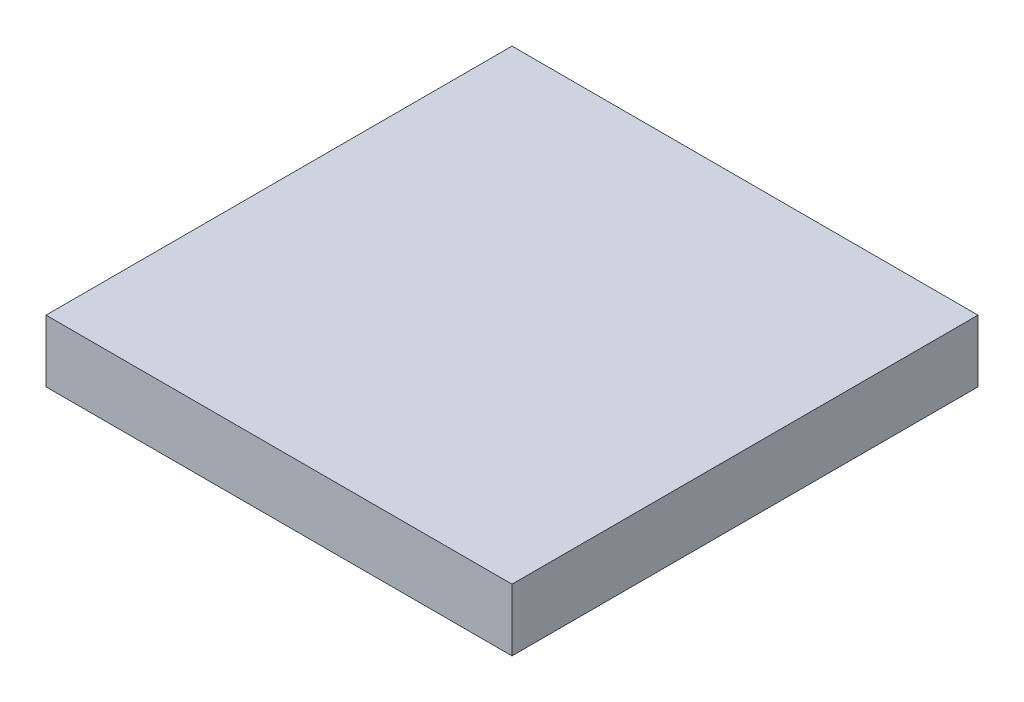
ISO-10303-21;
HEADER;
FILE_DESCRIPTION(('STEP AP214'),'2;1');
FILE_NAME('part.step','',(''),(''),'','','');
FILE_SCHEMA(('AUTOMOTIVE_DESIGN { 1 0 10303 214 1 1 1 1 }'));
ENDSEC;
DATA;
#1=APPLICATION_CONTEXT('core data for automotive mechanical design processes');
#2=APPLICATION_PROTOCOL_DEFINITION('international standard','automotive_design',2000,#1);
#3=PRODUCT_CONTEXT('',#1,'mechanical');
#4=PRODUCT('Part','Part','',(#3));
#5=PRODUCT_RELATED_PRODUCT_CATEGORY('part','',(#4));
#6=PRODUCT_DEFINITION_FORMATION('','',#4);
#7=PRODUCT_DEFINITION_CONTEXT('part definition',#1,'design');
#8=PRODUCT_DEFINITION('design','',#6,#7);
#9=PRODUCT_DEFINITION_SHAPE('','',#8);
#10=(LENGTH_UNIT() NAMED_UNIT(*) SI_UNIT(.MILLI.,.METRE.));
#11=(NAMED_UNIT(*) PLANE_ANGLE_UNIT() SI_UNIT($,.RADIAN.));
#12=(NAMED_UNIT(*) SI_UNIT($,.STERADIAN.) SOLID_ANGLE_UNIT());
#13=UNCERTAINTY_MEASURE_WITH_UNIT(LENGTH_MEASURE(1.E-05),#10,'distance_accuracy_value','');
#14=(GEOMETRIC_REPRESENTATION_CONTEXT(3) GLOBAL_UNCERTAINTY_ASSIGNED_CONTEXT((#13)) GLOBAL_UNIT_ASSIGNED_CONTEXT((#10,
#11,#12)) REPRESENTATION_CONTEXT('',''));
#15=CARTESIAN_POINT('',(0.,0.,0.));
#16=DIRECTION('',(0.,0.,1.));
#17=DIRECTION('',(1.,0.,0.));
#18=AXIS2_PLACEMENT_3D('',#15,#16,#17);
#19=CARTESIAN_POINT('',(0.,1.6,-12.));
#20=DIRECTION('',(1.,0.,0.));
#21=DIRECTION('',(0.,0.,-1.));
#22=AXIS2_PLACEMENT_3D('',#19,#20,#21);
#23=PLANE('',#22);
#24=DIRECTION('',(0.,0.,1.));
#25=VECTOR('',#24,1.);
#26=CARTESIAN_POINT('',(0.,0.,-12.));
#27=LINE('',#26,#25);
#28=CARTESIAN_POINT('',(0.,0.,-12.));
#29=VERTEX_POINT('',#28);
#30=CARTESIAN_POINT('',(0.,0.,0.));
#31=VERTEX_POINT('',#30);
#32=EDGE_CURVE('E110',#29,#31,#27,.T.);
#33=ORIENTED_EDGE('',*,*,#32,.T.);
#34=DIRECTION('',(0.,-1.,0.));
#35=VECTOR('',#34,1.);
#36=CARTESIAN_POINT('',(0.,1.6,0.));
#37=LINE('',#36,#35);
#38=CARTESIAN_POINT('',(0.,1.6,0.));
#39=VERTEX_POINT('',#38);
#40=EDGE_CURVE('E11',#39,#31,#37,.T.);
#41=ORIENTED_EDGE('',*,*,#40,.F.);
#42=DIRECTION('',(0.,0.,1.));
#43=VECTOR('',#42,1.);
#44=CARTESIAN_POINT('',(0.,1.6,-12.));
#45=LINE('',#44,#43);
#46=CARTESIAN_POINT('',(0.,1.6,-12.));
#47=VERTEX_POINT('',#46);
#48=EDGE_CURVE('E94',#47,#39,#45,.T.);
#49=ORIENTED_EDGE('',*,*,#48,.F.);
#50=DIRECTION('',(0.,-1.,0.));
#51=VECTOR('',#50,1.);
#52=CARTESIAN_POINT('',(0.,1.6,-12.));
#53=LINE('',#52,#51);
#54=EDGE_CURVE('E106',#47,#29,#53,.T.);
#55=ORIENTED_EDGE('',*,*,#54,.T.);
#56=EDGE_LOOP('',(#33,#41,#49,#55));
#57=FACE_BOUND('',#56,.T.);
#58=ADVANCED_FACE('F42',(#57),#23,.F.);
#59=CARTESIAN_POINT('',(0.,1.6,0.));
#60=DIRECTION('',(0.,0.,-1.));
#61=DIRECTION('',(-1.,0.,0.));
#62=AXIS2_PLACEMENT_3D('',#59,#60,#61);
#63=PLANE('',#62);
#64=DIRECTION('',(1.,0.,0.));
#65=VECTOR('',#64,1.);
#66=CARTESIAN_POINT('',(0.,0.,0.));
#67=LINE('',#66,#65);
#68=CARTESIAN_POINT('',(12.,0.,0.));
#69=VERTEX_POINT('',#68);
#70=EDGE_CURVE('E99',#31,#69,#67,.T.);
#71=ORIENTED_EDGE('',*,*,#70,.T.);
#72=DIRECTION('',(0.,-1.,0.));
#73=VECTOR('',#72,1.);
#74=CARTESIAN_POINT('',(12.,1.6,0.));
#75=LINE('',#74,#73);
#76=CARTESIAN_POINT('',(12.,1.6,0.));
#77=VERTEX_POINT('',#76);
#78=EDGE_CURVE('E51',#77,#69,#75,.T.);
#79=ORIENTED_EDGE('',*,*,#78,.F.);
#80=DIRECTION('',(1.,0.,0.));
#81=VECTOR('',#80,1.);
#82=CARTESIAN_POINT('',(0.,1.6,0.));
#83=LINE('',#82,#81);
#84=EDGE_CURVE('E89',#39,#77,#83,.T.);
#85=ORIENTED_EDGE('',*,*,#84,.F.);
#86=ORIENTED_EDGE('',*,*,#40,.T.);
#87=EDGE_LOOP('',(#71,#79,#85,#86));
#88=FACE_BOUND('',#87,.T.);
#89=ADVANCED_FACE('F98',(#88),#63,.F.);
#90=CARTESIAN_POINT('',(12.,1.6,-12.));
#91=DIRECTION('',(-1.,0.,0.));
#92=DIRECTION('',(0.,0.,1.));
#93=AXIS2_PLACEMENT_3D('',#90,#91,#92);
#94=PLANE('',#93);
#95=DIRECTION('',(0.,0.,-1.));
#96=VECTOR('',#95,1.);
#97=CARTESIAN_POINT('',(12.,0.,-12.));
#98=LINE('',#97,#96);
#99=CARTESIAN_POINT('',(12.,0.,-12.));
#100=VERTEX_POINT('',#99);
#101=EDGE_CURVE('E76',#69,#100,#98,.T.);
#102=ORIENTED_EDGE('',*,*,#101,.T.);
#103=DIRECTION('',(0.,-1.,0.));
#104=VECTOR('',#103,1.);
#105=CARTESIAN_POINT('',(12.,1.6,-12.));
#106=LINE('',#105,#104);
#107=CARTESIAN_POINT('',(12.,1.6,-12.));
#108=VERTEX_POINT('',#107);
#109=EDGE_CURVE('E101',#108,#100,#106,.T.);
#110=ORIENTED_EDGE('',*,*,#109,.F.);
#111=DIRECTION('',(0.,0.,-1.));
#112=VECTOR('',#111,1.);
#113=CARTESIAN_POINT('',(12.,1.6,-12.));
#114=LINE('',#113,#112);
#115=EDGE_CURVE('E92',#77,#108,#114,.T.);
#116=ORIENTED_EDGE('',*,*,#115,.F.);
#117=ORIENTED_EDGE('',*,*,#78,.T.);
#118=EDGE_LOOP('',(#102,#110,#116,#117));
#119=FACE_BOUND('',#118,.T.);
#120=ADVANCED_FACE('F102',(#119),#94,.F.);
#121=CARTESIAN_POINT('',(0.,1.6,-12.));
#122=DIRECTION('',(0.,0.,1.));
#123=DIRECTION('',(1.,0.,0.));
#124=AXIS2_PLACEMENT_3D('',#121,#122,#123);
#125=PLANE('',#124);
#126=DIRECTION('',(-1.,0.,0.));
#127=VECTOR('',#126,1.);
#128=CARTESIAN_POINT('',(0.,0.,-12.));
#129=LINE('',#128,#127);
#130=EDGE_CURVE('E82',#100,#29,#129,.T.);
#131=ORIENTED_EDGE('',*,*,#130,.T.);
#132=ORIENTED_EDGE('',*,*,#54,.F.);
#133=DIRECTION('',(-1.,0.,0.));
#134=VECTOR('',#133,1.);
#135=CARTESIAN_POINT('',(0.,1.6,-12.));
#136=LINE('',#135,#134);
#137=EDGE_CURVE('E59',#108,#47,#136,.T.);
#138=ORIENTED_EDGE('',*,*,#137,.F.);
#139=ORIENTED_EDGE('',*,*,#109,.T.);
#140=EDGE_LOOP('',(#131,#132,#138,#139));
#141=FACE_BOUND('',#140,.T.);
#142=ADVANCED_FACE('F123',(#141),#125,.F.);
#143=CARTESIAN_POINT('',(0.,1.6,0.));
#144=DIRECTION('',(0.,1.,0.));
#145=DIRECTION('',(0.,0.,1.));
#146=AXIS2_PLACEMENT_3D('',#143,#144,#145);
#147=PLANE('',#146);
#148=ORIENTED_EDGE('',*,*,#48,.T.);
#149=ORIENTED_EDGE('',*,*,#84,.T.);
#150=ORIENTED_EDGE('',*,*,#115,.T.);
#151=ORIENTED_EDGE('',*,*,#137,.T.);
#152=EDGE_LOOP('',(#148,#149,#150,#151));
#153=FACE_BOUND('',#152,.T.);
#154=ADVANCED_FACE('F90',(#153),#147,.T.);
#155=CARTESIAN_POINT('',(0.,0.,0.));
#156=DIRECTION('',(0.,1.,0.));
#157=DIRECTION('',(0.,0.,1.));
#158=AXIS2_PLACEMENT_3D('',#155,#156,#157);
#159=PLANE('',#158);
#160=ORIENTED_EDGE('',*,*,#32,.F.);
#161=ORIENTED_EDGE('',*,*,#130,.F.);
#162=ORIENTED_EDGE('',*,*,#101,.F.);
#163=ORIENTED_EDGE('',*,*,#70,.F.);
#164=EDGE_LOOP('',(#160,#161,#162,#163));
#165=FACE_BOUND('',#164,.T.);
#166=ADVANCED_FACE('F126',(#165),#159,.F.);
#167=CLOSED_SHELL('',(#58,#89,#120,#142,#154,#166));
#168=MANIFOLD_SOLID_BREP('B2',#167);
#169=ADVANCED_BREP_SHAPE_REPRESENTATION('',(#18,#168),#14);
#170=SHAPE_DEFINITION_REPRESENTATION(#9,#169);
ENDSEC;
END-ISO-10303-21;
